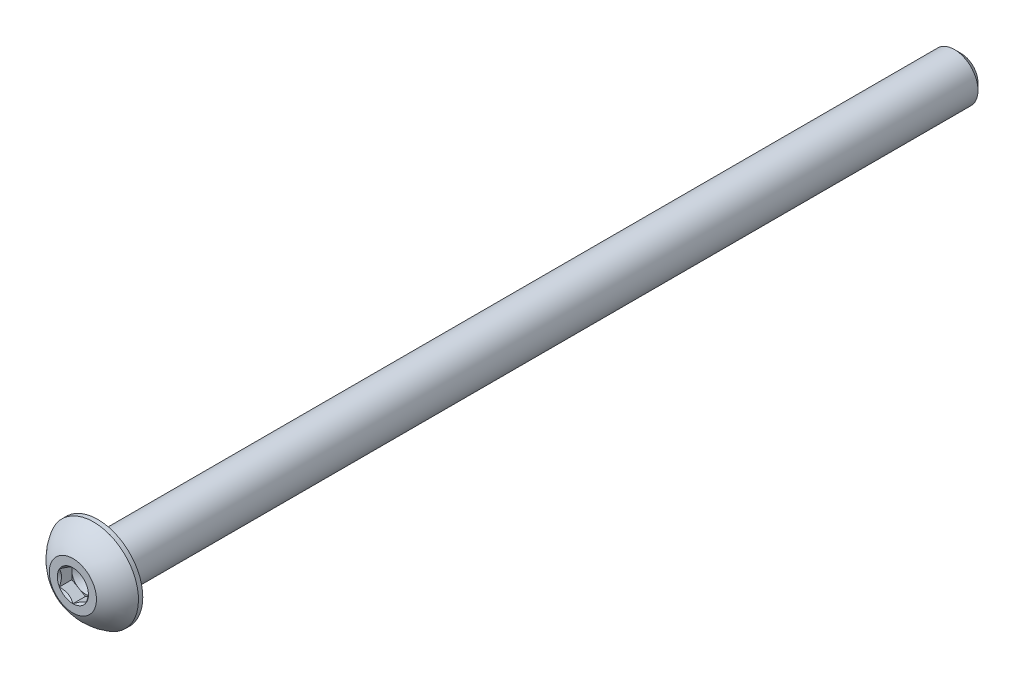
ISO-10303-21;
HEADER;
FILE_DESCRIPTION(('STEP AP214'),'2;1');
FILE_NAME('part.step','',(''),(''),'','','');
FILE_SCHEMA(('AUTOMOTIVE_DESIGN { 1 0 10303 214 1 1 1 1 }'));
ENDSEC;
DATA;
#1=APPLICATION_CONTEXT('core data for automotive mechanical design processes');
#2=APPLICATION_PROTOCOL_DEFINITION('international standard','automotive_design',2000,#1);
#3=PRODUCT_CONTEXT('',#1,'mechanical');
#4=PRODUCT('Part','Part','',(#3));
#5=PRODUCT_RELATED_PRODUCT_CATEGORY('part','',(#4));
#6=PRODUCT_DEFINITION_FORMATION('','',#4);
#7=PRODUCT_DEFINITION_CONTEXT('part definition',#1,'design');
#8=PRODUCT_DEFINITION('design','',#6,#7);
#9=PRODUCT_DEFINITION_SHAPE('','',#8);
#10=(LENGTH_UNIT() NAMED_UNIT(*) SI_UNIT(.MILLI.,.METRE.));
#11=(NAMED_UNIT(*) PLANE_ANGLE_UNIT() SI_UNIT($,.RADIAN.));
#12=(NAMED_UNIT(*) SI_UNIT($,.STERADIAN.) SOLID_ANGLE_UNIT());
#13=UNCERTAINTY_MEASURE_WITH_UNIT(LENGTH_MEASURE(1.E-05),#10,'distance_accuracy_value','');
#14=(GEOMETRIC_REPRESENTATION_CONTEXT(3) GLOBAL_UNCERTAINTY_ASSIGNED_CONTEXT((#13)) GLOBAL_UNIT_ASSIGNED_CONTEXT((#10,
#11,#12)) REPRESENTATION_CONTEXT('',''));
#15=CARTESIAN_POINT('',(0.,0.,0.));
#16=DIRECTION('',(0.,0.,1.));
#17=DIRECTION('',(1.,0.,0.));
#18=AXIS2_PLACEMENT_3D('',#15,#16,#17);
#19=CARTESIAN_POINT('',(1.190625,-2.06222299276169,1.1049));
#20=DIRECTION('',(0.,0.,1.));
#21=DIRECTION('',(1.,0.,0.));
#22=AXIS2_PLACEMENT_3D('',#19,#20,#21);
#23=PLANE('',#22);
#24=CARTESIAN_POINT('',(0.,0.,1.1049));
#25=DIRECTION('',(0.,0.,1.));
#26=DIRECTION('',(1.,0.,0.));
#27=AXIS2_PLACEMENT_3D('',#24,#25,#26);
#28=CIRCLE('',#27,1.190625);
#29=CARTESIAN_POINT('',(1.190625,0.,1.1049));
#30=VERTEX_POINT('',#29);
#31=CARTESIAN_POINT('',(0.5953125,1.03111149638085,1.1049));
#32=VERTEX_POINT('',#31);
#33=EDGE_CURVE('E44',#30,#32,#28,.T.);
#34=ORIENTED_EDGE('',*,*,#33,.F.);
#35=DIRECTION('',(0.,1.,0.));
#36=VECTOR('',#35,1.);
#37=CARTESIAN_POINT('',(1.190625,-0.687407664253899,1.1049));
#38=LINE('',#37,#36);
#39=CARTESIAN_POINT('',(1.190625,0.687407664253899,1.1049));
#40=VERTEX_POINT('',#39);
#41=EDGE_CURVE('E114',#30,#40,#38,.T.);
#42=ORIENTED_EDGE('',*,*,#41,.T.);
#43=DIRECTION('',(-0.866025403784439,0.5,0.));
#44=VECTOR('',#43,1.);
#45=CARTESIAN_POINT('',(1.190625,0.687407664253899,1.1049));
#46=LINE('',#45,#44);
#47=EDGE_CURVE('E117',#40,#32,#46,.T.);
#48=ORIENTED_EDGE('',*,*,#47,.T.);
#49=EDGE_LOOP('',(#34,#42,#48));
#50=FACE_BOUND('',#49,.T.);
#51=ADVANCED_FACE('F33',(#50),#23,.T.);
#52=CARTESIAN_POINT('',(-0.5953125,1.03111149638085,1.1049));
#53=VERTEX_POINT('',#52);
#54=EDGE_CURVE('E11',#32,#53,#28,.T.);
#55=ORIENTED_EDGE('',*,*,#54,.F.);
#56=CARTESIAN_POINT('',(0.,1.3748153285078,1.1049));
#57=VERTEX_POINT('',#56);
#58=EDGE_CURVE('E131',#32,#57,#46,.T.);
#59=ORIENTED_EDGE('',*,*,#58,.T.);
#60=DIRECTION('',(-0.866025403784439,-0.5,0.));
#61=VECTOR('',#60,1.);
#62=CARTESIAN_POINT('',(0.,1.3748153285078,1.1049));
#63=LINE('',#62,#61);
#64=EDGE_CURVE('E137',#57,#53,#63,.T.);
#65=ORIENTED_EDGE('',*,*,#64,.T.);
#66=EDGE_LOOP('',(#55,#59,#65));
#67=FACE_BOUND('',#66,.T.);
#68=ADVANCED_FACE('F193',(#67),#23,.T.);
#69=CARTESIAN_POINT('',(-1.190625,0.,1.1049));
#70=VERTEX_POINT('',#69);
#71=EDGE_CURVE('E42',#53,#70,#28,.T.);
#72=ORIENTED_EDGE('',*,*,#71,.F.);
#73=CARTESIAN_POINT('',(-1.190625,0.687407664253899,1.1049));
#74=VERTEX_POINT('',#73);
#75=EDGE_CURVE('E136',#53,#74,#63,.T.);
#76=ORIENTED_EDGE('',*,*,#75,.T.);
#77=DIRECTION('',(0.,-1.,0.));
#78=VECTOR('',#77,1.);
#79=CARTESIAN_POINT('',(-1.190625,0.687407664253899,1.1049));
#80=LINE('',#79,#78);
#81=EDGE_CURVE('E141',#74,#70,#80,.T.);
#82=ORIENTED_EDGE('',*,*,#81,.T.);
#83=EDGE_LOOP('',(#72,#76,#82));
#84=FACE_BOUND('',#83,.T.);
#85=ADVANCED_FACE('F198',(#84),#23,.T.);
#86=CARTESIAN_POINT('',(-0.5953125,-1.03111149638085,1.1049));
#87=VERTEX_POINT('',#86);
#88=EDGE_CURVE('E228',#70,#87,#28,.T.);
#89=ORIENTED_EDGE('',*,*,#88,.F.);
#90=CARTESIAN_POINT('',(-1.190625,-0.687407664253898,1.1049));
#91=VERTEX_POINT('',#90);
#92=EDGE_CURVE('E140',#70,#91,#80,.T.);
#93=ORIENTED_EDGE('',*,*,#92,.T.);
#94=DIRECTION('',(0.866025403784439,-0.5,0.));
#95=VECTOR('',#94,1.);
#96=CARTESIAN_POINT('',(-1.190625,-0.687407664253898,1.1049));
#97=LINE('',#96,#95);
#98=EDGE_CURVE('E233',#91,#87,#97,.T.);
#99=ORIENTED_EDGE('',*,*,#98,.T.);
#100=EDGE_LOOP('',(#89,#93,#99));
#101=FACE_BOUND('',#100,.T.);
#102=ADVANCED_FACE('F216',(#101),#23,.T.);
#103=CARTESIAN_POINT('',(0.595312499999999,-1.03111149638085,1.1049));
#104=VERTEX_POINT('',#103);
#105=EDGE_CURVE('E51',#87,#104,#28,.T.);
#106=ORIENTED_EDGE('',*,*,#105,.F.);
#107=CARTESIAN_POINT('',(0.,-1.3748153285078,1.1049));
#108=VERTEX_POINT('',#107);
#109=EDGE_CURVE('E225',#87,#108,#97,.T.);
#110=ORIENTED_EDGE('',*,*,#109,.T.);
#111=DIRECTION('',(0.866025403784439,0.5,0.));
#112=VECTOR('',#111,1.);
#113=CARTESIAN_POINT('',(0.,-1.3748153285078,1.1049));
#114=LINE('',#113,#112);
#115=EDGE_CURVE('E126',#108,#104,#114,.T.);
#116=ORIENTED_EDGE('',*,*,#115,.T.);
#117=EDGE_LOOP('',(#106,#110,#116));
#118=FACE_BOUND('',#117,.T.);
#119=ADVANCED_FACE('F205',(#118),#23,.T.);
#120=CARTESIAN_POINT('',(0.,0.,0.));
#121=DIRECTION('',(0.,0.,-1.));
#122=DIRECTION('',(0.,1.,0.));
#123=AXIS2_PLACEMENT_3D('',#120,#121,#122);
#124=CYLINDRICAL_SURFACE('',#123,2.0828);
#125=CARTESIAN_POINT('',(0.,0.,-75.6046875));
#126=DIRECTION('',(0.,0.,-1.));
#127=DIRECTION('',(0.,1.,0.));
#128=AXIS2_PLACEMENT_3D('',#125,#126,#127);
#129=CIRCLE('',#128,2.0828);
#130=CARTESIAN_POINT('',(0.,2.0828,-75.6046875));
#131=VERTEX_POINT('',#130);
#132=EDGE_CURVE('E37',#131,#131,#129,.F.);
#133=ORIENTED_EDGE('',*,*,#132,.T.);
#134=EDGE_LOOP('',(#133));
#135=FACE_BOUND('',#134,.T.);
#136=CARTESIAN_POINT('',(0.,0.,0.));
#137=DIRECTION('',(0.,0.,1.));
#138=DIRECTION('',(1.,0.,0.));
#139=AXIS2_PLACEMENT_3D('',#136,#137,#138);
#140=CIRCLE('',#139,2.0828);
#141=CARTESIAN_POINT('',(2.0828,0.,0.));
#142=VERTEX_POINT('',#141);
#143=EDGE_CURVE('E168',#142,#142,#140,.F.);
#144=ORIENTED_EDGE('',*,*,#143,.T.);
#145=EDGE_LOOP('',(#144));
#146=FACE_BOUND('',#145,.T.);
#147=ADVANCED_FACE('F177',(#135,#146),#124,.T.);
#148=CARTESIAN_POINT('',(0.,0.,-76.2));
#149=DIRECTION('',(0.,0.,-1.));
#150=DIRECTION('',(0.,1.,0.));
#151=AXIS2_PLACEMENT_3D('',#148,#149,#150);
#152=PLANE('',#151);
#153=CARTESIAN_POINT('',(0.,0.,-76.2));
#154=DIRECTION('',(0.,0.,-1.));
#155=DIRECTION('',(0.,1.,0.));
#156=AXIS2_PLACEMENT_3D('',#153,#154,#155);
#157=CIRCLE('',#156,1.4874875);
#158=CARTESIAN_POINT('',(0.,1.48748750000001,-76.2));
#159=VERTEX_POINT('',#158);
#160=EDGE_CURVE('E170',#159,#159,#157,.T.);
#161=ORIENTED_EDGE('',*,*,#160,.T.);
#162=EDGE_LOOP('',(#161));
#163=FACE_BOUND('',#162,.T.);
#164=ADVANCED_FACE('F183',(#163),#152,.T.);
#165=CARTESIAN_POINT('',(0.,0.,-76.2));
#166=DIRECTION('',(0.,0.,1.));
#167=DIRECTION('',(0.,-1.,0.));
#168=AXIS2_PLACEMENT_3D('',#165,#166,#167);
#169=CONICAL_SURFACE('',#168,1.4874875,0.785398163397431);
#170=ORIENTED_EDGE('',*,*,#132,.F.);
#171=EDGE_LOOP('',(#170));
#172=FACE_BOUND('',#171,.T.);
#173=ORIENTED_EDGE('',*,*,#160,.F.);
#174=EDGE_LOOP('',(#173));
#175=FACE_BOUND('',#174,.T.);
#176=ADVANCED_FACE('F35',(#172,#175),#169,.T.);
#177=CARTESIAN_POINT('',(0.,0.,13.4171596390943));
#178=DIRECTION('',(0.,0.,-1.));
#179=DIRECTION('',(-1.,0.,0.));
#180=AXIS2_PLACEMENT_3D('',#177,#178,#179);
#181=CYLINDRICAL_SURFACE('',#180,3.9624);
#182=CARTESIAN_POINT('',(0.,0.,0.381));
#183=DIRECTION('',(0.,0.,-1.));
#184=DIRECTION('',(0.,1.,0.));
#185=AXIS2_PLACEMENT_3D('',#182,#183,#184);
#186=CIRCLE('',#185,3.9624);
#187=CARTESIAN_POINT('',(0.,3.9624,0.381));
#188=VERTEX_POINT('',#187);
#189=EDGE_CURVE('E162',#188,#188,#186,.T.);
#190=ORIENTED_EDGE('',*,*,#189,.T.);
#191=EDGE_LOOP('',(#190));
#192=FACE_BOUND('',#191,.T.);
#193=CARTESIAN_POINT('',(0.,0.,0.));
#194=DIRECTION('',(0.,0.,1.));
#195=DIRECTION('',(1.,0.,0.));
#196=AXIS2_PLACEMENT_3D('',#193,#194,#195);
#197=CIRCLE('',#196,3.9624);
#198=CARTESIAN_POINT('',(3.9624,0.,0.));
#199=VERTEX_POINT('',#198);
#200=EDGE_CURVE('E165',#199,#199,#197,.T.);
#201=ORIENTED_EDGE('',*,*,#200,.T.);
#202=EDGE_LOOP('',(#201));
#203=FACE_BOUND('',#202,.T.);
#204=ADVANCED_FACE('F182',(#192,#203),#181,.T.);
#205=CARTESIAN_POINT('',(0.,0.,0.));
#206=DIRECTION('',(0.,0.,1.));
#207=DIRECTION('',(1.,0.,0.));
#208=AXIS2_PLACEMENT_3D('',#205,#206,#207);
#209=PLANE('',#208);
#210=ORIENTED_EDGE('',*,*,#143,.F.);
#211=EDGE_LOOP('',(#210));
#212=FACE_BOUND('',#211,.T.);
#213=ORIENTED_EDGE('',*,*,#200,.F.);
#214=EDGE_LOOP('',(#213));
#215=FACE_BOUND('',#214,.T.);
#216=ADVANCED_FACE('F188',(#212,#215),#209,.F.);
#217=CARTESIAN_POINT('',(0.,0.,-1.81116111111111));
#218=DIRECTION('',(0.,0.,-1.));
#219=DIRECTION('',(0.,1.,0.));
#220=AXIS2_PLACEMENT_3D('',#217,#218,#219);
#221=SPHERICAL_SURFACE('',#220,4.52837543685016);
#222=ORIENTED_EDGE('',*,*,#189,.F.);
#223=EDGE_LOOP('',(#222));
#224=FACE_BOUND('',#223,.T.);
#225=CARTESIAN_POINT('',(0.,0.,2.2098));
#226=DIRECTION('',(0.,0.,-1.));
#227=DIRECTION('',(0.,1.,0.));
#228=AXIS2_PLACEMENT_3D('',#225,#226,#227);
#229=CIRCLE('',#228,2.0828);
#230=CARTESIAN_POINT('',(0.,2.0828,2.2098));
#231=VERTEX_POINT('',#230);
#232=EDGE_CURVE('E148',#231,#231,#229,.T.);
#233=ORIENTED_EDGE('',*,*,#232,.T.);
#234=EDGE_LOOP('',(#233));
#235=FACE_BOUND('',#234,.T.);
#236=ADVANCED_FACE('F433',(#224,#235),#221,.T.);
#237=CARTESIAN_POINT('',(0.,0.,2.2098));
#238=DIRECTION('',(0.,0.,1.));
#239=DIRECTION('',(1.,0.,0.));
#240=AXIS2_PLACEMENT_3D('',#237,#238,#239);
#241=PLANE('',#240);
#242=CARTESIAN_POINT('',(0.,0.,2.2098));
#243=DIRECTION('',(0.,0.,1.));
#244=DIRECTION('',(1.,0.,0.));
#245=AXIS2_PLACEMENT_3D('',#242,#243,#244);
#246=CIRCLE('',#245,1.3748153285078);
#247=CARTESIAN_POINT('',(1.190625,0.687407664253898,2.2098));
#248=VERTEX_POINT('',#247);
#249=CARTESIAN_POINT('',(0.,1.3748153285078,2.2098));
#250=VERTEX_POINT('',#249);
#251=EDGE_CURVE('E494',#248,#250,#246,.T.);
#252=ORIENTED_EDGE('',*,*,#251,.F.);
#253=CARTESIAN_POINT('',(1.190625,-0.687407664253899,2.2098));
#254=VERTEX_POINT('',#253);
#255=EDGE_CURVE('E498',#254,#248,#246,.T.);
#256=ORIENTED_EDGE('',*,*,#255,.F.);
#257=CARTESIAN_POINT('',(0.,-1.3748153285078,2.2098));
#258=VERTEX_POINT('',#257);
#259=EDGE_CURVE('E504',#258,#254,#246,.T.);
#260=ORIENTED_EDGE('',*,*,#259,.F.);
#261=CARTESIAN_POINT('',(-1.190625,-0.687407664253897,2.2098));
#262=VERTEX_POINT('',#261);
#263=EDGE_CURVE('E507',#262,#258,#246,.T.);
#264=ORIENTED_EDGE('',*,*,#263,.F.);
#265=CARTESIAN_POINT('',(-1.190625,0.687407664253899,2.2098));
#266=VERTEX_POINT('',#265);
#267=EDGE_CURVE('E58',#266,#262,#246,.T.);
#268=ORIENTED_EDGE('',*,*,#267,.F.);
#269=EDGE_CURVE('E499',#250,#266,#246,.T.);
#270=ORIENTED_EDGE('',*,*,#269,.F.);
#271=EDGE_LOOP('',(#252,#256,#260,#264,#268,#270));
#272=FACE_BOUND('',#271,.T.);
#273=ORIENTED_EDGE('',*,*,#232,.F.);
#274=EDGE_LOOP('',(#273));
#275=FACE_BOUND('',#274,.T.);
#276=ADVANCED_FACE('F411',(#272,#275),#241,.T.);
#277=CARTESIAN_POINT('',(0.,0.,2.2098));
#278=DIRECTION('',(0.,0.,1.));
#279=DIRECTION('',(1.,0.,0.));
#280=AXIS2_PLACEMENT_3D('',#277,#278,#279);
#281=CONICAL_SURFACE('',#280,1.3748153285078,0.78539816339745);
#282=ORIENTED_EDGE('',*,*,#259,.T.);
#283=CARTESIAN_POINT('',(-0.000200000000000588,-1.37493079856163,2.20991548460002));
#284=CARTESIAN_POINT('',(0.0407344195898557,-1.35129730039231,2.18629876421426));
#285=CARTESIAN_POINT('',(0.082353388301973,-1.32726857760297,2.16406878172312));
#286=CARTESIAN_POINT('',(0.167219443673632,-1.27827113768909,2.12336566262744));
#287=CARTESIAN_POINT('',(0.21047460729096,-1.25329775733078,2.10491518264755));
#288=CARTESIAN_POINT('',(0.297696647457423,-1.2029400889614,2.07330883800432));
#289=CARTESIAN_POINT('',(0.341641294957924,-1.17756863489755,2.06007350424332));
#290=CARTESIAN_POINT('',(0.430498374163693,-1.12626697629869,2.03968145157539));
#291=CARTESIAN_POINT('',(0.475408088834754,-1.10033834044413,2.03250950289599));
#292=CARTESIAN_POINT('',(0.552804127656977,-1.0556537165959,2.02603853864886));
#293=CARTESIAN_POINT('',(0.585190412515646,-1.0369554863147,2.02508032014679));
#294=CARTESIAN_POINT('',(0.649906073317769,-0.99959188212981,2.02669264907208));
#295=CARTESIAN_POINT('',(0.682235435127272,-0.980926516386364,2.02926397517958));
#296=CARTESIAN_POINT('',(0.746582156071484,-0.943775919727754,2.03778675399362));
#297=CARTESIAN_POINT('',(0.778599196336767,-0.925290872911938,2.04374135475256));
#298=CARTESIAN_POINT('',(0.842098763396456,-0.888629380776601,2.0587099640712));
#299=CARTESIAN_POINT('',(0.873581054644163,-0.870453071450031,2.06772528591205));
#300=CARTESIAN_POINT('',(0.954214838572126,-0.823899134593444,2.09448229583802));
#301=CARTESIAN_POINT('',(1.00285783526766,-0.795815087357089,2.11423681443601));
#302=CARTESIAN_POINT('',(1.09823941635212,-0.740746505842244,2.15873676895768));
#303=CARTESIAN_POINT('',(1.14498361758715,-0.713758728676141,2.18346596471616));
#304=CARTESIAN_POINT('',(1.190825,-0.687292194200061,2.20991548460002));
#305=B_SPLINE_CURVE_WITH_KNOTS('',3,(#283,#284,#285,#286,#287,#288,#289,#290,#291,#292,#293,
#294,#295,#296,#297,#298,#299,#300,#301,#302,#303,#304),.UNSPECIFIED.,.F.,.F.,(4,2,2,2,2,2,2,2,
2,2,4),(0.,0.15862567293412,0.318176079843271,0.475191357500655,0.631811068630748,
0.743878551794717,0.855970763007028,0.968167444423241,1.08041232768376,1.25873351645467,
1.43648174479847),.UNSPECIFIED.);
#306=EDGE_CURVE('E260',#258,#254,#305,.T.);
#307=ORIENTED_EDGE('',*,*,#306,.F.);
#308=EDGE_LOOP('',(#282,#307));
#309=FACE_BOUND('',#308,.T.);
#310=ADVANCED_FACE('F214',(#309),#281,.F.);
#311=ORIENTED_EDGE('',*,*,#255,.T.);
#312=CARTESIAN_POINT('',(1.190625,-1.39767913930363,2.67103882839214));
#313=CARTESIAN_POINT('',(1.190625,-1.36376433084891,2.64522539246509));
#314=CARTESIAN_POINT('',(1.190625,-1.3296634893196,2.61965709887897));
#315=CARTESIAN_POINT('',(1.190625,-1.26101322840552,2.56911280907949));
#316=CARTESIAN_POINT('',(1.190625,-1.22646370126591,2.54413695937391));
#317=CARTESIAN_POINT('',(1.190625,-1.1215216440958,2.4698945786979));
#318=CARTESIAN_POINT('',(1.190625,-1.05035071679897,2.42171026948543));
#319=CARTESIAN_POINT('',(1.190625,-0.900933191969143,2.32687034336278));
#320=CARTESIAN_POINT('',(1.190625,-0.822517828974597,2.28047768398758));
#321=CARTESIAN_POINT('',(1.190625,-0.661737009481328,2.19544317598995));
#322=CARTESIAN_POINT('',(1.190625,-0.579386096602594,2.15677516828437));
#323=CARTESIAN_POINT('',(1.190625,-0.456029791160727,2.10946066970227));
#324=CARTESIAN_POINT('',(1.190625,-0.416907616313723,2.0959268733063));
#325=CARTESIAN_POINT('',(1.190625,-0.33769543150606,2.0719970971604));
#326=CARTESIAN_POINT('',(1.190625,-0.297605357303342,2.06160132631135));
#327=CARTESIAN_POINT('',(1.190625,-0.21737984402491,2.04466863477105));
#328=CARTESIAN_POINT('',(1.190625,-0.17725894034859,2.03806393941707));
#329=CARTESIAN_POINT('',(1.190625,-0.0965585381896976,2.02884669890966));
#330=CARTESIAN_POINT('',(1.190625,-0.0559791265583124,2.02623341005856));
#331=CARTESIAN_POINT('',(1.190625,0.0236374274714251,2.02520502746247));
#332=CARTESIAN_POINT('',(1.190625,0.062672535957278,2.02662905214768));
#333=CARTESIAN_POINT('',(1.190625,0.140424737140747,2.03323569951394));
#334=CARTESIAN_POINT('',(1.190625,0.179141769064046,2.038419024329));
#335=CARTESIAN_POINT('',(1.190625,0.256628029013004,2.05234489281415));
#336=CARTESIAN_POINT('',(1.190625,0.295386057238,2.06114879544162));
#337=CARTESIAN_POINT('',(1.190625,0.372051668322044,2.08183989220622));
#338=CARTESIAN_POINT('',(1.190625,0.409959312676497,2.09372686260568));
#339=CARTESIAN_POINT('',(1.190625,0.528117098311747,2.1352822103908));
#340=CARTESIAN_POINT('',(1.190625,0.606715931702217,2.16963334734987));
#341=CARTESIAN_POINT('',(1.190625,0.76023135423417,2.24604106103475));
#342=CARTESIAN_POINT('',(1.190625,0.835133582483724,2.28812508336625));
#343=CARTESIAN_POINT('',(1.190625,0.978298651364951,2.3749827882419));
#344=CARTESIAN_POINT('',(1.190625,1.04670661641749,2.41952025086913));
#345=CARTESIAN_POINT('',(1.190625,1.14749153671046,2.48838553297949));
#346=CARTESIAN_POINT('',(1.190625,1.18065216228132,2.51158635357252));
#347=CARTESIAN_POINT('',(1.190625,1.24651945903993,2.55860557617975));
#348=CARTESIAN_POINT('',(1.190625,1.2792262518855,2.58242380757629));
#349=CARTESIAN_POINT('',(1.190625,1.31174392576079,2.60649815362981));
#350=B_SPLINE_CURVE_WITH_KNOTS('',3,(#312,#313,#314,#315,#316,#317,#318,#319,#320,#321,#322,
#323,#324,#325,#326,#327,#328,#329,#330,#331,#332,#333,#334,#335,#336,#337,#338,#339,#340,#341,
#342,#343,#344,#345,#346,#347,#348,#349),.UNSPECIFIED.,.F.,.F.,(4,2,2,2,2,2,2,2,2,2,2,2,2,2,2,2,
2,2,4),(0.,0.127859759061888,0.255750814207432,0.513482848499943,0.786600118645501,
1.05877620101641,1.18286265868535,1.30695737506862,1.42875834338065,1.5505366143925,
1.6675311739265,1.78454759046009,1.90363466608285,2.02271310199493,2.27929327934998,
2.53680234799431,2.78156601882657,2.90297444261856,3.02434966627986),.UNSPECIFIED.);
#351=EDGE_CURVE('E269',#254,#248,#350,.T.);
#352=ORIENTED_EDGE('',*,*,#351,.F.);
#353=EDGE_LOOP('',(#311,#352));
#354=FACE_BOUND('',#353,.T.);
#355=ADVANCED_FACE('F396',(#354),#281,.F.);
#356=ORIENTED_EDGE('',*,*,#251,.T.);
#357=CARTESIAN_POINT('',(1.190825,0.687292194200061,2.20991548460002));
#358=CARTESIAN_POINT('',(1.14989058041014,0.710925692369386,2.18629876421426));
#359=CARTESIAN_POINT('',(1.10827161169803,0.734954415158722,2.16406878172312));
#360=CARTESIAN_POINT('',(1.02340555632637,0.78395185507261,2.12336566262744));
#361=CARTESIAN_POINT('',(0.980150392709039,0.808925235430916,2.10491518264755));
#362=CARTESIAN_POINT('',(0.892928352542576,0.859282903800292,2.07330883800432));
#363=CARTESIAN_POINT('',(0.848983705042075,0.884654357864149,2.06007350424332));
#364=CARTESIAN_POINT('',(0.760126625836306,0.935956016463004,2.0396814515754));
#365=CARTESIAN_POINT('',(0.715216911165245,0.96188465231757,2.03250950289599));
#366=CARTESIAN_POINT('',(0.637820872343022,1.00656927616579,2.02603853864886));
#367=CARTESIAN_POINT('',(0.605434587484353,1.025267506447,2.02508032014679));
#368=CARTESIAN_POINT('',(0.54071892668223,1.06263111063189,2.02669264907208));
#369=CARTESIAN_POINT('',(0.508389564872727,1.08129647637533,2.02926397517958));
#370=CARTESIAN_POINT('',(0.444042843928515,1.11844707303394,2.03778675399362));
#371=CARTESIAN_POINT('',(0.412025803663232,1.13693211984976,2.04374135475256));
#372=CARTESIAN_POINT('',(0.348526236603542,1.17359361198509,2.0587099640712));
#373=CARTESIAN_POINT('',(0.317043945355835,1.19176992131166,2.06772528591206));
#374=CARTESIAN_POINT('',(0.236410161427873,1.23832385816825,2.09448229583802));
#375=CARTESIAN_POINT('',(0.187767164732342,1.26640790540461,2.11423681443601));
#376=CARTESIAN_POINT('',(0.0923855836478813,1.32147648691945,2.15873676895768));
#377=CARTESIAN_POINT('',(0.045641382412845,1.34846426408555,2.18346596471616));
#378=CARTESIAN_POINT('',(-0.000199999999999557,1.37493079856163,2.20991548460002));
#379=B_SPLINE_CURVE_WITH_KNOTS('',3,(#357,#358,#359,#360,#361,#362,#363,#364,#365,#366,#367,
#368,#369,#370,#371,#372,#373,#374,#375,#376,#377,#378),.UNSPECIFIED.,.F.,.F.,(4,2,2,2,2,2,2,2,
2,2,4),(0.,0.15862567293412,0.318176079843271,0.475191357500655,0.631811068630748,
0.743878551794718,0.855970763007029,0.968167444423242,1.08041232768377,1.25873351645467,
1.43648174479847),.UNSPECIFIED.);
#380=EDGE_CURVE('E277',#248,#250,#379,.T.);
#381=ORIENTED_EDGE('',*,*,#380,.F.);
#382=EDGE_LOOP('',(#356,#381));
#383=FACE_BOUND('',#382,.T.);
#384=ADVANCED_FACE('F388',(#383),#281,.F.);
#385=ORIENTED_EDGE('',*,*,#269,.T.);
#386=CARTESIAN_POINT('',(0.000200000000000338,1.37493079856163,2.20991548460002));
#387=CARTESIAN_POINT('',(-0.040734419589856,1.35129730039231,2.18629876421426));
#388=CARTESIAN_POINT('',(-0.0823533883019735,1.32726857760297,2.16406878172312));
#389=CARTESIAN_POINT('',(-0.167219443673632,1.27827113768909,2.12336566262744));
#390=CARTESIAN_POINT('',(-0.210474607290961,1.25329775733078,2.10491518264755));
#391=CARTESIAN_POINT('',(-0.297696647457424,1.2029400889614,2.07330883800432));
#392=CARTESIAN_POINT('',(-0.341641294957925,1.17756863489755,2.06007350424332));
#393=CARTESIAN_POINT('',(-0.430498374163693,1.12626697629869,2.0396814515754));
#394=CARTESIAN_POINT('',(-0.475408088834755,1.10033834044413,2.03250950289599));
#395=CARTESIAN_POINT('',(-0.552804127656978,1.0556537165959,2.02603853864886));
#396=CARTESIAN_POINT('',(-0.585190412515647,1.0369554863147,2.02508032014679));
#397=CARTESIAN_POINT('',(-0.64990607331777,0.99959188212981,2.02669264907208));
#398=CARTESIAN_POINT('',(-0.682235435127273,0.980926516386364,2.02926397517958));
#399=CARTESIAN_POINT('',(-0.746582156071485,0.943775919727754,2.03778675399362));
#400=CARTESIAN_POINT('',(-0.778599196336768,0.925290872911938,2.04374135475256));
#401=CARTESIAN_POINT('',(-0.842098763396457,0.888629380776601,2.0587099640712));
#402=CARTESIAN_POINT('',(-0.873581054644164,0.870453071450031,2.06772528591206));
#403=CARTESIAN_POINT('',(-0.954214838572127,0.823899134593444,2.09448229583802));
#404=CARTESIAN_POINT('',(-1.00285783526766,0.795815087357089,2.11423681443601));
#405=CARTESIAN_POINT('',(-1.09823941635212,0.740746505842244,2.15873676895768));
#406=CARTESIAN_POINT('',(-1.14498361758716,0.713758728676141,2.18346596471616));
#407=CARTESIAN_POINT('',(-1.190825,0.687292194200061,2.20991548460002));
#408=B_SPLINE_CURVE_WITH_KNOTS('',3,(#386,#387,#388,#389,#390,#391,#392,#393,#394,#395,#396,
#397,#398,#399,#400,#401,#402,#403,#404,#405,#406,#407),.UNSPECIFIED.,.F.,.F.,(4,2,2,2,2,2,2,2,
2,2,4),(0.,0.158625672934121,0.318176079843271,0.475191357500656,0.631811068630749,
0.743878551794718,0.855970763007029,0.968167444423242,1.08041232768377,1.25873351645467,
1.43648174479847),.UNSPECIFIED.);
#409=EDGE_CURVE('E283',#250,#266,#408,.T.);
#410=ORIENTED_EDGE('',*,*,#409,.F.);
#411=EDGE_LOOP('',(#385,#410));
#412=FACE_BOUND('',#411,.T.);
#413=ADVANCED_FACE('F381',(#412),#281,.F.);
#414=ORIENTED_EDGE('',*,*,#267,.T.);
#415=CARTESIAN_POINT('',(-1.190625,-1.39767913930363,2.67103882839214));
#416=CARTESIAN_POINT('',(-1.190625,-1.36376433084891,2.64522539246509));
#417=CARTESIAN_POINT('',(-1.190625,-1.3296634893196,2.61965709887897));
#418=CARTESIAN_POINT('',(-1.190625,-1.26101322840551,2.56911280907949));
#419=CARTESIAN_POINT('',(-1.190625,-1.22646370126591,2.54413695937391));
#420=CARTESIAN_POINT('',(-1.190625,-1.1215216440958,2.4698945786979));
#421=CARTESIAN_POINT('',(-1.190625,-1.05035071679897,2.42171026948543));
#422=CARTESIAN_POINT('',(-1.190625,-0.900933191969142,2.32687034336278));
#423=CARTESIAN_POINT('',(-1.190625,-0.822517828974596,2.28047768398759));
#424=CARTESIAN_POINT('',(-1.190625,-0.661737009481328,2.19544317598995));
#425=CARTESIAN_POINT('',(-1.190625,-0.579386096602594,2.15677516828437));
#426=CARTESIAN_POINT('',(-1.190625,-0.456029791160727,2.10946066970227));
#427=CARTESIAN_POINT('',(-1.190625,-0.416907616313723,2.0959268733063));
#428=CARTESIAN_POINT('',(-1.190625,-0.337695431506059,2.0719970971604));
#429=CARTESIAN_POINT('',(-1.190625,-0.297605357303341,2.06160132631135));
#430=CARTESIAN_POINT('',(-1.190625,-0.217379844024909,2.04466863477106));
#431=CARTESIAN_POINT('',(-1.190625,-0.177258940348589,2.03806393941707));
#432=CARTESIAN_POINT('',(-1.190625,-0.0965585381896967,2.02884669890966));
#433=CARTESIAN_POINT('',(-1.190625,-0.0559791265583116,2.02623341005856));
#434=CARTESIAN_POINT('',(-1.190625,0.0236374274714259,2.02520502746247));
#435=CARTESIAN_POINT('',(-1.190625,0.0626725359572788,2.02662905214768));
#436=CARTESIAN_POINT('',(-1.190625,0.140424737140748,2.03323569951394));
#437=CARTESIAN_POINT('',(-1.190625,0.179141769064047,2.038419024329));
#438=CARTESIAN_POINT('',(-1.190625,0.256628029013005,2.05234489281415));
#439=CARTESIAN_POINT('',(-1.190625,0.295386057238001,2.06114879544162));
#440=CARTESIAN_POINT('',(-1.190625,0.372051668322045,2.08183989220622));
#441=CARTESIAN_POINT('',(-1.190625,0.409959312676498,2.09372686260568));
#442=CARTESIAN_POINT('',(-1.190625,0.528117098311748,2.1352822103908));
#443=CARTESIAN_POINT('',(-1.190625,0.606715931702219,2.16963334734988));
#444=CARTESIAN_POINT('',(-1.190625,0.760231354234172,2.24604106103475));
#445=CARTESIAN_POINT('',(-1.190625,0.835133582483726,2.28812508336625));
#446=CARTESIAN_POINT('',(-1.190625,0.978298651364954,2.3749827882419));
#447=CARTESIAN_POINT('',(-1.190625,1.0467066164175,2.41952025086913));
#448=CARTESIAN_POINT('',(-1.190625,1.14749153671046,2.48838553297949));
#449=CARTESIAN_POINT('',(-1.190625,1.18065216228132,2.51158635357252));
#450=CARTESIAN_POINT('',(-1.190625,1.24651945903993,2.55860557617975));
#451=CARTESIAN_POINT('',(-1.190625,1.2792262518855,2.58242380757629));
#452=CARTESIAN_POINT('',(-1.190625,1.31174392576079,2.60649815362981));
#453=B_SPLINE_CURVE_WITH_KNOTS('',3,(#415,#416,#417,#418,#419,#420,#421,#422,#423,#424,#425,
#426,#427,#428,#429,#430,#431,#432,#433,#434,#435,#436,#437,#438,#439,#440,#441,#442,#443,#444,
#445,#446,#447,#448,#449,#450,#451,#452),.UNSPECIFIED.,.F.,.F.,(4,2,2,2,2,2,2,2,2,2,2,2,2,2,2,2,
2,2,4),(0.,0.127859759061888,0.255750814207432,0.513482848499942,0.786600118645501,
1.05877620101641,1.18286265868535,1.30695737506862,1.42875834338065,1.5505366143925,
1.6675311739265,1.78454759046009,1.90363466608285,2.02271310199493,2.27929327934998,
2.53680234799431,2.78156601882657,2.90297444261856,3.02434966627986),.UNSPECIFIED.);
#454=EDGE_CURVE('E246',#266,#262,#453,.F.);
#455=ORIENTED_EDGE('',*,*,#454,.F.);
#456=EDGE_LOOP('',(#414,#455));
#457=FACE_BOUND('',#456,.T.);
#458=ADVANCED_FACE('F212',(#457),#281,.F.);
#459=ORIENTED_EDGE('',*,*,#263,.T.);
#460=CARTESIAN_POINT('',(-1.190825,-0.68729219420006,2.20991548460002));
#461=CARTESIAN_POINT('',(-1.14989058041014,-0.710925692369385,2.18629876421426));
#462=CARTESIAN_POINT('',(-1.10827161169803,-0.734954415158721,2.16406878172312));
#463=CARTESIAN_POINT('',(-1.02340555632637,-0.783951855072609,2.12336566262744));
#464=CARTESIAN_POINT('',(-0.980150392709039,-0.808925235430915,2.10491518264755));
#465=CARTESIAN_POINT('',(-0.892928352542576,-0.859282903800291,2.07330883800432));
#466=CARTESIAN_POINT('',(-0.848983705042075,-0.884654357864149,2.06007350424332));
#467=CARTESIAN_POINT('',(-0.760126625836306,-0.935956016463003,2.03968145157539));
#468=CARTESIAN_POINT('',(-0.715216911165245,-0.96188465231757,2.03250950289599));
#469=CARTESIAN_POINT('',(-0.637820872343022,-1.00656927616579,2.02603853864886));
#470=CARTESIAN_POINT('',(-0.605434587484353,-1.025267506447,2.02508032014679));
#471=CARTESIAN_POINT('',(-0.54071892668223,-1.06263111063189,2.02669264907208));
#472=CARTESIAN_POINT('',(-0.508389564872727,-1.08129647637533,2.02926397517958));
#473=CARTESIAN_POINT('',(-0.444042843928515,-1.11844707303394,2.03778675399362));
#474=CARTESIAN_POINT('',(-0.412025803663232,-1.13693211984976,2.04374135475256));
#475=CARTESIAN_POINT('',(-0.348526236603543,-1.17359361198509,2.0587099640712));
#476=CARTESIAN_POINT('',(-0.317043945355836,-1.19176992131166,2.06772528591206));
#477=CARTESIAN_POINT('',(-0.236410161427873,-1.23832385816825,2.09448229583802));
#478=CARTESIAN_POINT('',(-0.187767164732342,-1.26640790540461,2.11423681443601));
#479=CARTESIAN_POINT('',(-0.0923855836478816,-1.32147648691945,2.15873676895768));
#480=CARTESIAN_POINT('',(-0.0456413824128451,-1.34846426408555,2.18346596471616));
#481=CARTESIAN_POINT('',(0.000199999999999341,-1.37493079856163,2.20991548460002));
#482=B_SPLINE_CURVE_WITH_KNOTS('',3,(#460,#461,#462,#463,#464,#465,#466,#467,#468,#469,#470,
#471,#472,#473,#474,#475,#476,#477,#478,#479,#480,#481),.UNSPECIFIED.,.F.,.F.,(4,2,2,2,2,2,2,2,
2,2,4),(0.,0.15862567293412,0.318176079843271,0.475191357500656,0.631811068630749,
0.743878551794718,0.855970763007029,0.968167444423242,1.08041232768377,1.25873351645467,
1.43648174479847),.UNSPECIFIED.);
#483=EDGE_CURVE('E235',#262,#258,#482,.T.);
#484=ORIENTED_EDGE('',*,*,#483,.F.);
#485=EDGE_LOOP('',(#459,#484));
#486=FACE_BOUND('',#485,.T.);
#487=ADVANCED_FACE('F204',(#486),#281,.F.);
#488=EDGE_CURVE('E104',#104,#30,#28,.T.);
#489=ORIENTED_EDGE('',*,*,#488,.F.);
#490=CARTESIAN_POINT('',(1.190625,-0.687407664253899,1.1049));
#491=VERTEX_POINT('',#490);
#492=EDGE_CURVE('E129',#104,#491,#114,.T.);
#493=ORIENTED_EDGE('',*,*,#492,.T.);
#494=EDGE_CURVE('E122',#491,#30,#38,.T.);
#495=ORIENTED_EDGE('',*,*,#494,.T.);
#496=EDGE_LOOP('',(#489,#493,#495));
#497=FACE_BOUND('',#496,.T.);
#498=ADVANCED_FACE('F128',(#497),#23,.T.);
#499=CARTESIAN_POINT('',(0.,-1.3748153285078,1.1049));
#500=DIRECTION('',(0.5,-0.866025403784439,0.));
#501=DIRECTION('',(0.866025403784439,0.5,0.));
#502=AXIS2_PLACEMENT_3D('',#499,#500,#501);
#503=PLANE('',#502);
#504=DIRECTION('',(0.,0.,1.));
#505=VECTOR('',#504,1.);
#506=CARTESIAN_POINT('',(0.,-1.3748153285078,1.1049));
#507=LINE('',#506,#505);
#508=EDGE_CURVE('E144',#108,#258,#507,.T.);
#509=ORIENTED_EDGE('',*,*,#508,.T.);
#510=ORIENTED_EDGE('',*,*,#306,.T.);
#511=DIRECTION('',(0.,0.,1.));
#512=VECTOR('',#511,1.);
#513=CARTESIAN_POINT('',(1.190625,-0.687407664253899,1.1049));
#514=LINE('',#513,#512);
#515=EDGE_CURVE('E156',#491,#254,#514,.T.);
#516=ORIENTED_EDGE('',*,*,#515,.F.);
#517=ORIENTED_EDGE('',*,*,#492,.F.);
#518=ORIENTED_EDGE('',*,*,#115,.F.);
#519=EDGE_LOOP('',(#509,#510,#516,#517,#518));
#520=FACE_BOUND('',#519,.T.);
#521=ADVANCED_FACE('F203',(#520),#503,.F.);
#522=CARTESIAN_POINT('',(1.190625,-0.687407664253899,1.1049));
#523=DIRECTION('',(1.,0.,0.));
#524=DIRECTION('',(0.,1.,0.));
#525=AXIS2_PLACEMENT_3D('',#522,#523,#524);
#526=PLANE('',#525);
#527=ORIENTED_EDGE('',*,*,#515,.T.);
#528=ORIENTED_EDGE('',*,*,#351,.T.);
#529=DIRECTION('',(0.,0.,1.));
#530=VECTOR('',#529,1.);
#531=CARTESIAN_POINT('',(1.190625,0.687407664253899,1.1049));
#532=LINE('',#531,#530);
#533=EDGE_CURVE('E125',#40,#248,#532,.T.);
#534=ORIENTED_EDGE('',*,*,#533,.F.);
#535=ORIENTED_EDGE('',*,*,#41,.F.);
#536=ORIENTED_EDGE('',*,*,#494,.F.);
#537=EDGE_LOOP('',(#527,#528,#534,#535,#536));
#538=FACE_BOUND('',#537,.T.);
#539=ADVANCED_FACE('F121',(#538),#526,.F.);
#540=CARTESIAN_POINT('',(1.190625,0.687407664253899,1.1049));
#541=DIRECTION('',(0.5,0.866025403784439,0.));
#542=DIRECTION('',(-0.866025403784439,0.5,0.));
#543=AXIS2_PLACEMENT_3D('',#540,#541,#542);
#544=PLANE('',#543);
#545=ORIENTED_EDGE('',*,*,#533,.T.);
#546=ORIENTED_EDGE('',*,*,#380,.T.);
#547=DIRECTION('',(0.,0.,1.));
#548=VECTOR('',#547,1.);
#549=CARTESIAN_POINT('',(0.,1.3748153285078,1.1049));
#550=LINE('',#549,#548);
#551=EDGE_CURVE('E152',#57,#250,#550,.T.);
#552=ORIENTED_EDGE('',*,*,#551,.F.);
#553=ORIENTED_EDGE('',*,*,#58,.F.);
#554=ORIENTED_EDGE('',*,*,#47,.F.);
#555=EDGE_LOOP('',(#545,#546,#552,#553,#554));
#556=FACE_BOUND('',#555,.T.);
#557=ADVANCED_FACE('F294',(#556),#544,.F.);
#558=CARTESIAN_POINT('',(0.,1.3748153285078,1.1049));
#559=DIRECTION('',(-0.5,0.866025403784439,0.));
#560=DIRECTION('',(-0.866025403784439,-0.5,0.));
#561=AXIS2_PLACEMENT_3D('',#558,#559,#560);
#562=PLANE('',#561);
#563=ORIENTED_EDGE('',*,*,#551,.T.);
#564=ORIENTED_EDGE('',*,*,#409,.T.);
#565=DIRECTION('',(0.,0.,1.));
#566=VECTOR('',#565,1.);
#567=CARTESIAN_POINT('',(-1.190625,0.687407664253899,1.1049));
#568=LINE('',#567,#566);
#569=EDGE_CURVE('E149',#74,#266,#568,.T.);
#570=ORIENTED_EDGE('',*,*,#569,.F.);
#571=ORIENTED_EDGE('',*,*,#75,.F.);
#572=ORIENTED_EDGE('',*,*,#64,.F.);
#573=EDGE_LOOP('',(#563,#564,#570,#571,#572));
#574=FACE_BOUND('',#573,.T.);
#575=ADVANCED_FACE('F290',(#574),#562,.F.);
#576=CARTESIAN_POINT('',(-1.190625,0.687407664253899,1.1049));
#577=DIRECTION('',(-1.,0.,0.));
#578=DIRECTION('',(0.,0.,1.));
#579=AXIS2_PLACEMENT_3D('',#576,#577,#578);
#580=PLANE('',#579);
#581=ORIENTED_EDGE('',*,*,#569,.T.);
#582=ORIENTED_EDGE('',*,*,#454,.T.);
#583=DIRECTION('',(0.,0.,1.));
#584=VECTOR('',#583,1.);
#585=CARTESIAN_POINT('',(-1.190625,-0.687407664253898,1.1049));
#586=LINE('',#585,#584);
#587=EDGE_CURVE('E145',#91,#262,#586,.T.);
#588=ORIENTED_EDGE('',*,*,#587,.F.);
#589=ORIENTED_EDGE('',*,*,#92,.F.);
#590=ORIENTED_EDGE('',*,*,#81,.F.);
#591=EDGE_LOOP('',(#581,#582,#588,#589,#590));
#592=FACE_BOUND('',#591,.T.);
#593=ADVANCED_FACE('F293',(#592),#580,.F.);
#594=CARTESIAN_POINT('',(-1.190625,-0.687407664253898,1.1049));
#595=DIRECTION('',(-0.5,-0.866025403784439,0.));
#596=DIRECTION('',(0.866025403784439,-0.5,0.));
#597=AXIS2_PLACEMENT_3D('',#594,#595,#596);
#598=PLANE('',#597);
#599=ORIENTED_EDGE('',*,*,#587,.T.);
#600=ORIENTED_EDGE('',*,*,#483,.T.);
#601=ORIENTED_EDGE('',*,*,#508,.F.);
#602=ORIENTED_EDGE('',*,*,#109,.F.);
#603=ORIENTED_EDGE('',*,*,#98,.F.);
#604=EDGE_LOOP('',(#599,#600,#601,#602,#603));
#605=FACE_BOUND('',#604,.T.);
#606=ADVANCED_FACE('F232',(#605),#598,.F.);
#607=CARTESIAN_POINT('',(0.,0.,1.1049));
#608=DIRECTION('',(0.,0.,1.));
#609=DIRECTION('',(1.,0.,0.));
#610=AXIS2_PLACEMENT_3D('',#607,#608,#609);
#611=CONICAL_SURFACE('',#610,1.190625,1.0471975511966);
#612=CARTESIAN_POINT('',(0.,0.,0.7366));
#613=DIRECTION('',(0.,0.,1.));
#614=DIRECTION('',(1.,0.,0.));
#615=AXIS2_PLACEMENT_3D('',#612,#613,#614);
#616=CIRCLE('',#615,0.552710687572379);
#617=CARTESIAN_POINT('',(0.552710687572379,0.,0.7366));
#618=VERTEX_POINT('',#617);
#619=EDGE_CURVE('E118',#618,#618,#616,.T.);
#620=ORIENTED_EDGE('',*,*,#619,.F.);
#621=EDGE_LOOP('',(#620));
#622=FACE_BOUND('',#621,.T.);
#623=ORIENTED_EDGE('',*,*,#33,.T.);
#624=ORIENTED_EDGE('',*,*,#54,.T.);
#625=ORIENTED_EDGE('',*,*,#71,.T.);
#626=ORIENTED_EDGE('',*,*,#88,.T.);
#627=ORIENTED_EDGE('',*,*,#105,.T.);
#628=ORIENTED_EDGE('',*,*,#488,.T.);
#629=EDGE_LOOP('',(#623,#624,#625,#626,#627,#628));
#630=FACE_BOUND('',#629,.T.);
#631=ADVANCED_FACE('F106',(#622,#630),#611,.F.);
#632=CARTESIAN_POINT('',(0.,0.,0.7366));
#633=DIRECTION('',(0.,0.,1.));
#634=DIRECTION('',(1.,0.,0.));
#635=AXIS2_PLACEMENT_3D('',#632,#633,#634);
#636=PLANE('',#635);
#637=ORIENTED_EDGE('',*,*,#619,.T.);
#638=EDGE_LOOP('',(#637));
#639=FACE_BOUND('',#638,.T.);
#640=ADVANCED_FACE('F332',(#639),#636,.T.);
#641=CLOSED_SHELL('',(#51,#68,#85,#102,#119,#147,#164,#176,#204,#216,#236,#276,#310,#355,#384,
#413,#458,#487,#498,#521,#539,#557,#575,#593,#606,#631,#640));
#642=MANIFOLD_SOLID_BREP('B2',#641);
#643=ADVANCED_BREP_SHAPE_REPRESENTATION('',(#18,#642),#14);
#644=SHAPE_DEFINITION_REPRESENTATION(#9,#643);
ENDSEC;
END-ISO-10303-21;
